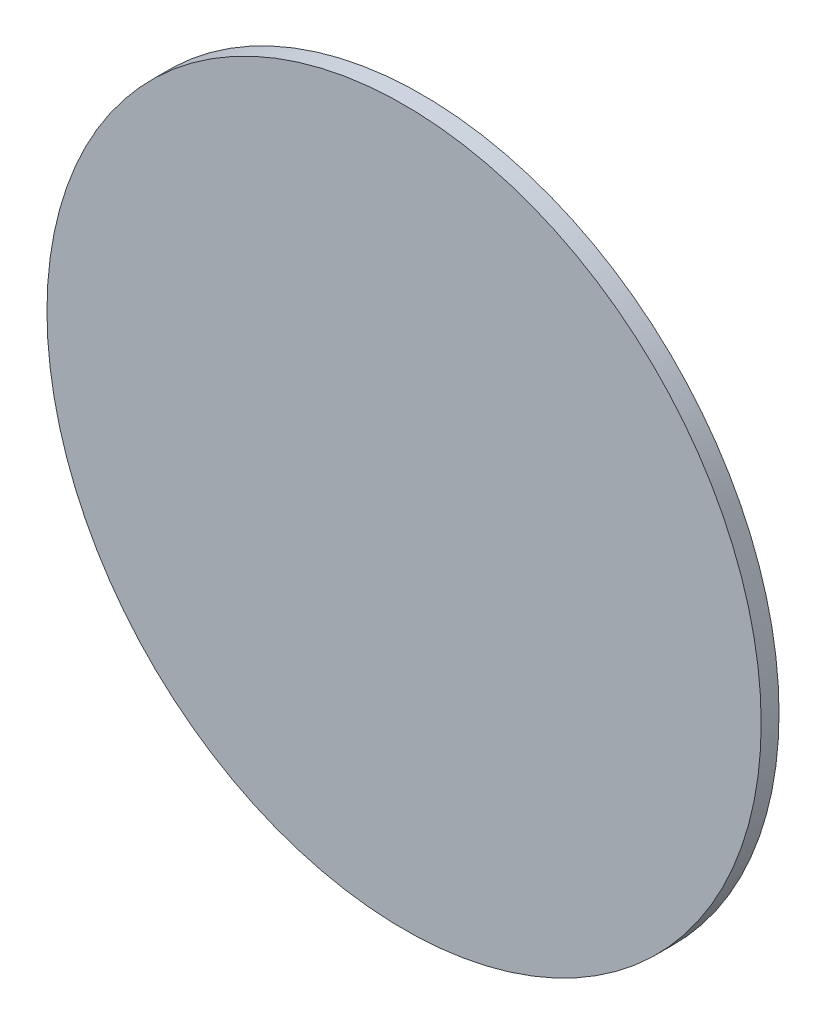
ISO-10303-21;
HEADER;
FILE_DESCRIPTION(('STEP AP214'),'2;1');
FILE_NAME('part.step','',(''),(''),'','','');
FILE_SCHEMA(('AUTOMOTIVE_DESIGN { 1 0 10303 214 1 1 1 1 }'));
ENDSEC;
DATA;
#1=APPLICATION_CONTEXT('core data for automotive mechanical design processes');
#2=APPLICATION_PROTOCOL_DEFINITION('international standard','automotive_design',2000,#1);
#3=PRODUCT_CONTEXT('',#1,'mechanical');
#4=PRODUCT('Part','Part','',(#3));
#5=PRODUCT_RELATED_PRODUCT_CATEGORY('part','',(#4));
#6=PRODUCT_DEFINITION_FORMATION('','',#4);
#7=PRODUCT_DEFINITION_CONTEXT('part definition',#1,'design');
#8=PRODUCT_DEFINITION('design','',#6,#7);
#9=PRODUCT_DEFINITION_SHAPE('','',#8);
#10=(LENGTH_UNIT() NAMED_UNIT(*) SI_UNIT(.MILLI.,.METRE.));
#11=(NAMED_UNIT(*) PLANE_ANGLE_UNIT() SI_UNIT($,.RADIAN.));
#12=(NAMED_UNIT(*) SI_UNIT($,.STERADIAN.) SOLID_ANGLE_UNIT());
#13=UNCERTAINTY_MEASURE_WITH_UNIT(LENGTH_MEASURE(1.E-05),#10,'distance_accuracy_value','');
#14=(GEOMETRIC_REPRESENTATION_CONTEXT(3) GLOBAL_UNCERTAINTY_ASSIGNED_CONTEXT((#13)) GLOBAL_UNIT_ASSIGNED_CONTEXT((#10,
#11,#12)) REPRESENTATION_CONTEXT('',''));
#15=CARTESIAN_POINT('',(0.,0.,0.));
#16=DIRECTION('',(0.,0.,1.));
#17=DIRECTION('',(1.,0.,0.));
#18=AXIS2_PLACEMENT_3D('',#15,#16,#17);
#19=CARTESIAN_POINT('',(0.,0.,3.175));
#20=DIRECTION('',(0.,0.,-1.));
#21=DIRECTION('',(-1.,0.,0.));
#22=AXIS2_PLACEMENT_3D('',#19,#20,#21);
#23=CYLINDRICAL_SURFACE('',#22,63.5);
#24=CARTESIAN_POINT('',(0.,0.,3.175));
#25=DIRECTION('',(0.,0.,1.));
#26=DIRECTION('',(1.,0.,0.));
#27=AXIS2_PLACEMENT_3D('',#24,#25,#26);
#28=CIRCLE('',#27,63.5);
#29=CARTESIAN_POINT('',(63.5,0.,3.175));
#30=VERTEX_POINT('',#29);
#31=EDGE_CURVE('E10',#30,#30,#28,.T.);
#32=ORIENTED_EDGE('',*,*,#31,.F.);
#33=EDGE_LOOP('',(#32));
#34=FACE_BOUND('',#33,.T.);
#35=CARTESIAN_POINT('',(0.,0.,0.));
#36=DIRECTION('',(0.,0.,1.));
#37=DIRECTION('',(1.,0.,0.));
#38=AXIS2_PLACEMENT_3D('',#35,#36,#37);
#39=CIRCLE('',#38,63.5);
#40=CARTESIAN_POINT('',(63.5,0.,0.));
#41=VERTEX_POINT('',#40);
#42=EDGE_CURVE('E34',#41,#41,#39,.T.);
#43=ORIENTED_EDGE('',*,*,#42,.T.);
#44=EDGE_LOOP('',(#43));
#45=FACE_BOUND('',#44,.T.);
#46=ADVANCED_FACE('F31',(#34,#45),#23,.T.);
#47=CARTESIAN_POINT('',(0.,0.,3.175));
#48=DIRECTION('',(0.,0.,1.));
#49=DIRECTION('',(1.,0.,0.));
#50=AXIS2_PLACEMENT_3D('',#47,#48,#49);
#51=PLANE('',#50);
#52=ORIENTED_EDGE('',*,*,#31,.T.);
#53=EDGE_LOOP('',(#52));
#54=FACE_BOUND('',#53,.T.);
#55=ADVANCED_FACE('F46',(#54),#51,.T.);
#56=CARTESIAN_POINT('',(0.,0.,0.));
#57=DIRECTION('',(0.,0.,1.));
#58=DIRECTION('',(1.,0.,0.));
#59=AXIS2_PLACEMENT_3D('',#56,#57,#58);
#60=PLANE('',#59);
#61=ORIENTED_EDGE('',*,*,#42,.F.);
#62=EDGE_LOOP('',(#61));
#63=FACE_BOUND('',#62,.T.);
#64=ADVANCED_FACE('F44',(#63),#60,.F.);
#65=CLOSED_SHELL('',(#46,#55,#64));
#66=MANIFOLD_SOLID_BREP('B2',#65);
#67=ADVANCED_BREP_SHAPE_REPRESENTATION('',(#18,#66),#14);
#68=SHAPE_DEFINITION_REPRESENTATION(#9,#67);
ENDSEC;
END-ISO-10303-21;
